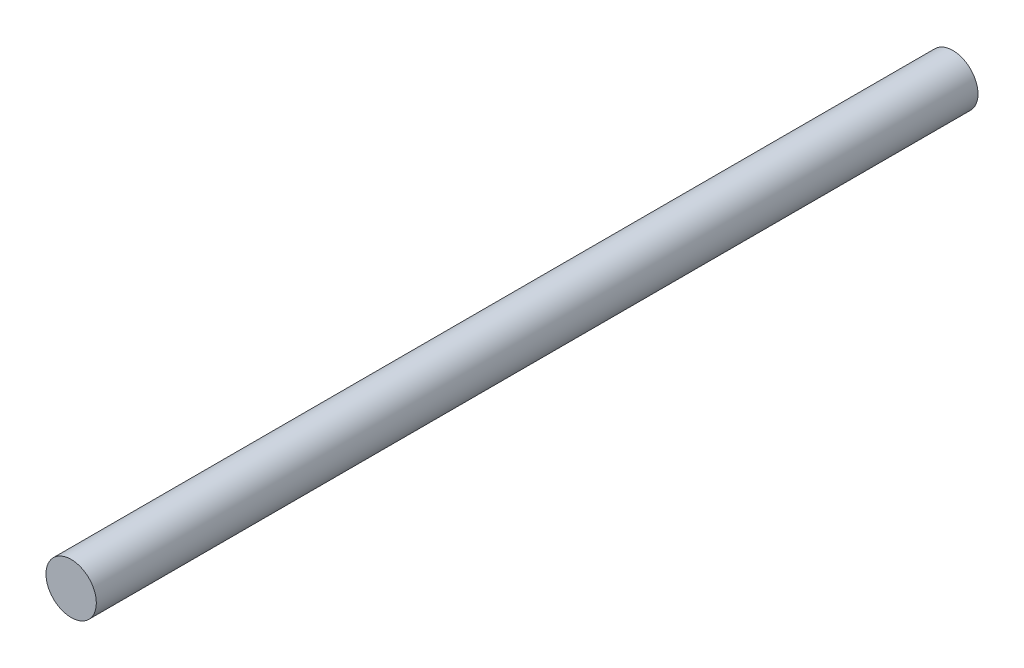
ISO-10303-21;
HEADER;
FILE_DESCRIPTION(('STEP AP214'),'2;1');
FILE_NAME('part.step','',(''),(''),'','','');
FILE_SCHEMA(('AUTOMOTIVE_DESIGN { 1 0 10303 214 1 1 1 1 }'));
ENDSEC;
DATA;
#1=APPLICATION_CONTEXT('core data for automotive mechanical design processes');
#2=APPLICATION_PROTOCOL_DEFINITION('international standard','automotive_design',2000,#1);
#3=PRODUCT_CONTEXT('',#1,'mechanical');
#4=PRODUCT('Part','Part','',(#3));
#5=PRODUCT_RELATED_PRODUCT_CATEGORY('part','',(#4));
#6=PRODUCT_DEFINITION_FORMATION('','',#4);
#7=PRODUCT_DEFINITION_CONTEXT('part definition',#1,'design');
#8=PRODUCT_DEFINITION('design','',#6,#7);
#9=PRODUCT_DEFINITION_SHAPE('','',#8);
#10=(LENGTH_UNIT() NAMED_UNIT(*) SI_UNIT(.MILLI.,.METRE.));
#11=(NAMED_UNIT(*) PLANE_ANGLE_UNIT() SI_UNIT($,.RADIAN.));
#12=(NAMED_UNIT(*) SI_UNIT($,.STERADIAN.) SOLID_ANGLE_UNIT());
#13=UNCERTAINTY_MEASURE_WITH_UNIT(LENGTH_MEASURE(1.E-05),#10,'distance_accuracy_value','');
#14=(GEOMETRIC_REPRESENTATION_CONTEXT(3) GLOBAL_UNCERTAINTY_ASSIGNED_CONTEXT((#13)) GLOBAL_UNIT_ASSIGNED_CONTEXT((#10,
#11,#12)) REPRESENTATION_CONTEXT('',''));
#15=CARTESIAN_POINT('',(0.,0.,0.));
#16=DIRECTION('',(0.,0.,1.));
#17=DIRECTION('',(1.,0.,0.));
#18=AXIS2_PLACEMENT_3D('',#15,#16,#17);
#19=CARTESIAN_POINT('',(0.,0.,70.));
#20=DIRECTION('',(0.,0.,-1.));
#21=DIRECTION('',(-1.,0.,0.));
#22=AXIS2_PLACEMENT_3D('',#19,#20,#21);
#23=CYLINDRICAL_SURFACE('',#22,2.);
#24=CARTESIAN_POINT('',(0.,0.,70.));
#25=DIRECTION('',(0.,0.,1.));
#26=DIRECTION('',(1.,0.,0.));
#27=AXIS2_PLACEMENT_3D('',#24,#25,#26);
#28=CIRCLE('',#27,2.);
#29=CARTESIAN_POINT('',(2.,0.,70.));
#30=VERTEX_POINT('',#29);
#31=EDGE_CURVE('E10',#30,#30,#28,.T.);
#32=ORIENTED_EDGE('',*,*,#31,.F.);
#33=EDGE_LOOP('',(#32));
#34=FACE_BOUND('',#33,.T.);
#35=CARTESIAN_POINT('',(0.,0.,0.));
#36=DIRECTION('',(0.,0.,1.));
#37=DIRECTION('',(1.,0.,0.));
#38=AXIS2_PLACEMENT_3D('',#35,#36,#37);
#39=CIRCLE('',#38,2.);
#40=CARTESIAN_POINT('',(2.,0.,0.));
#41=VERTEX_POINT('',#40);
#42=EDGE_CURVE('E35',#41,#41,#39,.T.);
#43=ORIENTED_EDGE('',*,*,#42,.T.);
#44=EDGE_LOOP('',(#43));
#45=FACE_BOUND('',#44,.T.);
#46=ADVANCED_FACE('F32',(#34,#45),#23,.T.);
#47=CARTESIAN_POINT('',(0.,0.,70.));
#48=DIRECTION('',(0.,0.,1.));
#49=DIRECTION('',(1.,0.,0.));
#50=AXIS2_PLACEMENT_3D('',#47,#48,#49);
#51=PLANE('',#50);
#52=ORIENTED_EDGE('',*,*,#31,.T.);
#53=EDGE_LOOP('',(#52));
#54=FACE_BOUND('',#53,.T.);
#55=ADVANCED_FACE('F47',(#54),#51,.T.);
#56=CARTESIAN_POINT('',(0.,0.,0.));
#57=DIRECTION('',(0.,0.,1.));
#58=DIRECTION('',(1.,0.,0.));
#59=AXIS2_PLACEMENT_3D('',#56,#57,#58);
#60=PLANE('',#59);
#61=ORIENTED_EDGE('',*,*,#42,.F.);
#62=EDGE_LOOP('',(#61));
#63=FACE_BOUND('',#62,.T.);
#64=ADVANCED_FACE('F45',(#63),#60,.F.);
#65=CLOSED_SHELL('',(#46,#55,#64));
#66=MANIFOLD_SOLID_BREP('B2',#65);
#67=ADVANCED_BREP_SHAPE_REPRESENTATION('',(#18,#66),#14);
#68=SHAPE_DEFINITION_REPRESENTATION(#9,#67);
ENDSEC;
END-ISO-10303-21;
